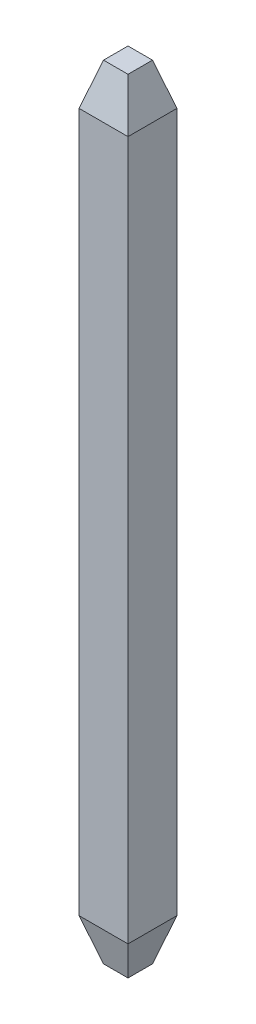
ISO-10303-21;
HEADER;
FILE_DESCRIPTION(('STEP AP214'),'2;1');
FILE_NAME('part.step','',(''),(''),'','','');
FILE_SCHEMA(('AUTOMOTIVE_DESIGN { 1 0 10303 214 1 1 1 1 }'));
ENDSEC;
DATA;
#1=APPLICATION_CONTEXT('core data for automotive mechanical design processes');
#2=APPLICATION_PROTOCOL_DEFINITION('international standard','automotive_design',2000,#1);
#3=PRODUCT_CONTEXT('',#1,'mechanical');
#4=PRODUCT('Part','Part','',(#3));
#5=PRODUCT_RELATED_PRODUCT_CATEGORY('part','',(#4));
#6=PRODUCT_DEFINITION_FORMATION('','',#4);
#7=PRODUCT_DEFINITION_CONTEXT('part definition',#1,'design');
#8=PRODUCT_DEFINITION('design','',#6,#7);
#9=PRODUCT_DEFINITION_SHAPE('','',#8);
#10=(LENGTH_UNIT() NAMED_UNIT(*) SI_UNIT(.MILLI.,.METRE.));
#11=(NAMED_UNIT(*) PLANE_ANGLE_UNIT() SI_UNIT($,.RADIAN.));
#12=(NAMED_UNIT(*) SI_UNIT($,.STERADIAN.) SOLID_ANGLE_UNIT());
#13=UNCERTAINTY_MEASURE_WITH_UNIT(LENGTH_MEASURE(1.E-05),#10,'distance_accuracy_value','');
#14=(GEOMETRIC_REPRESENTATION_CONTEXT(3) GLOBAL_UNCERTAINTY_ASSIGNED_CONTEXT((#13)) GLOBAL_UNIT_ASSIGNED_CONTEXT((#10,
#11,#12)) REPRESENTATION_CONTEXT('',''));
#15=CARTESIAN_POINT('',(0.,0.,0.));
#16=DIRECTION('',(0.,0.,1.));
#17=DIRECTION('',(1.,0.,0.));
#18=AXIS2_PLACEMENT_3D('',#15,#16,#17);
#19=CARTESIAN_POINT('',(-28.729999999987,-10.1039999999833,-19.5199999999763));
#20=DIRECTION('',(0.959644900900969,-0.281214622974642,0.));
#21=DIRECTION('',(0.,0.,-1.));
#22=AXIS2_PLACEMENT_3D('',#19,#20,#21);
#23=PLANE('',#22);
#24=DIRECTION('',(0.,0.,1.));
#25=VECTOR('',#24,1.);
#26=CARTESIAN_POINT('',(-28.729999999987,-10.1039999999833,-19.8399999999763));
#27=LINE('',#26,#25);
#28=CARTESIAN_POINT('',(-28.729999999987,-10.1039999999833,-19.8399999999763));
#29=VERTEX_POINT('',#28);
#30=CARTESIAN_POINT('',(-28.729999999987,-10.1039999999833,-19.1999999999763));
#31=VERTEX_POINT('',#30);
#32=EDGE_CURVE('E11',#29,#31,#27,.T.);
#33=ORIENTED_EDGE('',*,*,#32,.T.);
#34=DIRECTION('',(-0.270714017147726,-0.923811583516618,-0.270714017147726));
#35=VECTOR('',#34,1.);
#36=CARTESIAN_POINT('',(-28.729999999987,-10.1039999999833,-19.1999999999763));
#37=LINE('',#36,#35);
#38=CARTESIAN_POINT('',(-28.889999999987,-10.6499999999833,-19.3599999999763));
#39=VERTEX_POINT('',#38);
#40=EDGE_CURVE('E28',#31,#39,#37,.T.);
#41=ORIENTED_EDGE('',*,*,#40,.T.);
#42=DIRECTION('',(0.,0.,1.));
#43=VECTOR('',#42,1.);
#44=CARTESIAN_POINT('',(-28.889999999987,-10.6499999999833,-19.6799999999763));
#45=LINE('',#44,#43);
#46=CARTESIAN_POINT('',(-28.889999999987,-10.6499999999833,-19.6799999999763));
#47=VERTEX_POINT('',#46);
#48=EDGE_CURVE('E168',#47,#39,#45,.T.);
#49=ORIENTED_EDGE('',*,*,#48,.F.);
#50=DIRECTION('',(-0.270714017147726,-0.923811583516618,0.270714017147726));
#51=VECTOR('',#50,1.);
#52=CARTESIAN_POINT('',(-28.729999999987,-10.1039999999833,-19.8399999999763));
#53=LINE('',#52,#51);
#54=EDGE_CURVE('E131',#29,#47,#53,.T.);
#55=ORIENTED_EDGE('',*,*,#54,.F.);
#56=EDGE_LOOP('',(#33,#41,#49,#55));
#57=FACE_BOUND('',#56,.T.);
#58=ADVANCED_FACE('F17',(#57),#23,.T.);
#59=CARTESIAN_POINT('',(-28.729999999987,-11.0738701069128,-19.5199999999763));
#60=DIRECTION('',(1.,0.,0.));
#61=DIRECTION('',(0.,1.,0.));
#62=AXIS2_PLACEMENT_3D('',#59,#60,#61);
#63=PLANE('',#62);
#64=DIRECTION('',(0.,1.,0.));
#65=VECTOR('',#64,1.);
#66=CARTESIAN_POINT('',(-28.729999999987,-10.1039999999833,-19.1999999999763));
#67=LINE('',#66,#65);
#68=CARTESIAN_POINT('',(-28.729999999987,-0.965870106912755,-19.1999999999763));
#69=VERTEX_POINT('',#68);
#70=EDGE_CURVE('E41',#31,#69,#67,.T.);
#71=ORIENTED_EDGE('',*,*,#70,.F.);
#72=ORIENTED_EDGE('',*,*,#32,.F.);
#73=DIRECTION('',(0.,1.,0.));
#74=VECTOR('',#73,1.);
#75=CARTESIAN_POINT('',(-28.729999999987,-10.1039999999833,-19.8399999999763));
#76=LINE('',#75,#74);
#77=CARTESIAN_POINT('',(-28.729999999987,-0.965870106912755,-19.8399999999763));
#78=VERTEX_POINT('',#77);
#79=EDGE_CURVE('E147',#29,#78,#76,.T.);
#80=ORIENTED_EDGE('',*,*,#79,.T.);
#81=DIRECTION('',(0.,0.,1.));
#82=VECTOR('',#81,1.);
#83=CARTESIAN_POINT('',(-28.729999999987,-0.965870106912753,-19.8399999999763));
#84=LINE('',#83,#82);
#85=EDGE_CURVE('E153',#78,#69,#84,.T.);
#86=ORIENTED_EDGE('',*,*,#85,.T.);
#87=EDGE_LOOP('',(#71,#72,#80,#86));
#88=FACE_BOUND('',#87,.T.);
#89=ADVANCED_FACE('F362',(#88),#63,.T.);
#90=CARTESIAN_POINT('',(-29.370999999987,-5.53543505344803,-19.1999999999763));
#91=DIRECTION('',(0.,0.,1.));
#92=DIRECTION('',(1.,0.,0.));
#93=AXIS2_PLACEMENT_3D('',#90,#91,#92);
#94=PLANE('',#93);
#95=DIRECTION('',(0.,1.,0.));
#96=VECTOR('',#95,1.);
#97=CARTESIAN_POINT('',(-29.369999999987,-10.1039999999833,-19.1999999999763));
#98=LINE('',#97,#96);
#99=CARTESIAN_POINT('',(-29.369999999987,-10.1039999999833,-19.1999999999763));
#100=VERTEX_POINT('',#99);
#101=CARTESIAN_POINT('',(-29.369999999987,-0.965870106912755,-19.1999999999763));
#102=VERTEX_POINT('',#101);
#103=EDGE_CURVE('E99',#100,#102,#98,.T.);
#104=ORIENTED_EDGE('',*,*,#103,.F.);
#105=DIRECTION('',(-1.,0.,0.));
#106=VECTOR('',#105,1.);
#107=CARTESIAN_POINT('',(-28.729999999987,-10.1039999999833,-19.1999999999763));
#108=LINE('',#107,#106);
#109=EDGE_CURVE('E144',#31,#100,#108,.T.);
#110=ORIENTED_EDGE('',*,*,#109,.F.);
#111=ORIENTED_EDGE('',*,*,#70,.T.);
#112=DIRECTION('',(-1.,0.,0.));
#113=VECTOR('',#112,1.);
#114=CARTESIAN_POINT('',(-28.729999999987,-0.965870106912753,-19.1999999999763));
#115=LINE('',#114,#113);
#116=EDGE_CURVE('E111',#69,#102,#115,.T.);
#117=ORIENTED_EDGE('',*,*,#116,.T.);
#118=EDGE_LOOP('',(#104,#110,#111,#117));
#119=FACE_BOUND('',#118,.T.);
#120=ADVANCED_FACE('F113',(#119),#94,.T.);
#121=CARTESIAN_POINT('',(-29.369999999987,-5.53543505344803,-19.1989999999763));
#122=DIRECTION('',(-1.,0.,0.));
#123=DIRECTION('',(0.,0.,1.));
#124=AXIS2_PLACEMENT_3D('',#121,#122,#123);
#125=PLANE('',#124);
#126=DIRECTION('',(0.,1.,0.));
#127=VECTOR('',#126,1.);
#128=CARTESIAN_POINT('',(-29.369999999987,-10.1039999999833,-19.8399999999763));
#129=LINE('',#128,#127);
#130=CARTESIAN_POINT('',(-29.369999999987,-10.1039999999833,-19.8399999999763));
#131=VERTEX_POINT('',#130);
#132=CARTESIAN_POINT('',(-29.369999999987,-0.965870106912755,-19.8399999999763));
#133=VERTEX_POINT('',#132);
#134=EDGE_CURVE('E182',#131,#133,#129,.T.);
#135=ORIENTED_EDGE('',*,*,#134,.F.);
#136=DIRECTION('',(0.,0.,-1.));
#137=VECTOR('',#136,1.);
#138=CARTESIAN_POINT('',(-29.369999999987,-10.1039999999833,-19.1999999999763));
#139=LINE('',#138,#137);
#140=EDGE_CURVE('E106',#100,#131,#139,.T.);
#141=ORIENTED_EDGE('',*,*,#140,.F.);
#142=ORIENTED_EDGE('',*,*,#103,.T.);
#143=DIRECTION('',(0.,0.,-1.));
#144=VECTOR('',#143,1.);
#145=CARTESIAN_POINT('',(-29.369999999987,-0.965870106912753,-19.1999999999763));
#146=LINE('',#145,#144);
#147=EDGE_CURVE('E86',#102,#133,#146,.T.);
#148=ORIENTED_EDGE('',*,*,#147,.T.);
#149=EDGE_LOOP('',(#135,#141,#142,#148));
#150=FACE_BOUND('',#149,.T.);
#151=ADVANCED_FACE('F104',(#150),#125,.T.);
#152=CARTESIAN_POINT('',(-29.369999999987,-0.965870106912753,-19.5199999999763));
#153=DIRECTION('',(-0.959644900900968,0.281214622974644,0.));
#154=DIRECTION('',(0.,0.,1.));
#155=AXIS2_PLACEMENT_3D('',#152,#153,#154);
#156=PLANE('',#155);
#157=DIRECTION('',(0.270714017147727,0.923811583516617,-0.270714017147727));
#158=VECTOR('',#157,1.);
#159=CARTESIAN_POINT('',(-29.369999999987,-0.965870106912753,-19.1999999999763));
#160=LINE('',#159,#158);
#161=CARTESIAN_POINT('',(-29.209999999987,-0.419870106912756,-19.3599999999763));
#162=VERTEX_POINT('',#161);
#163=EDGE_CURVE('E92',#102,#162,#160,.T.);
#164=ORIENTED_EDGE('',*,*,#163,.T.);
#165=DIRECTION('',(0.,0.,-1.));
#166=VECTOR('',#165,1.);
#167=CARTESIAN_POINT('',(-29.209999999987,-0.419870106912754,-19.3599999999763));
#168=LINE('',#167,#166);
#169=CARTESIAN_POINT('',(-29.209999999987,-0.419870106912756,-19.6799999999763));
#170=VERTEX_POINT('',#169);
#171=EDGE_CURVE('E122',#162,#170,#168,.T.);
#172=ORIENTED_EDGE('',*,*,#171,.T.);
#173=DIRECTION('',(0.270714017147727,0.923811583516617,0.270714017147727));
#174=VECTOR('',#173,1.);
#175=CARTESIAN_POINT('',(-29.369999999987,-0.965870106912753,-19.8399999999763));
#176=LINE('',#175,#174);
#177=EDGE_CURVE('E95',#133,#170,#176,.T.);
#178=ORIENTED_EDGE('',*,*,#177,.F.);
#179=ORIENTED_EDGE('',*,*,#147,.F.);
#180=EDGE_LOOP('',(#164,#172,#178,#179));
#181=FACE_BOUND('',#180,.T.);
#182=ADVANCED_FACE('F88',(#181),#156,.T.);
#183=CARTESIAN_POINT('',(-29.049999999987,-0.965870106912753,-19.8399999999763));
#184=DIRECTION('',(0.,0.281214622974644,-0.959644900900968));
#185=DIRECTION('',(-1.,0.,0.));
#186=AXIS2_PLACEMENT_3D('',#183,#184,#185);
#187=PLANE('',#186);
#188=ORIENTED_EDGE('',*,*,#177,.T.);
#189=DIRECTION('',(1.,0.,0.));
#190=VECTOR('',#189,1.);
#191=CARTESIAN_POINT('',(-29.209999999987,-0.419870106912754,-19.6799999999763));
#192=LINE('',#191,#190);
#193=CARTESIAN_POINT('',(-28.889999999987,-0.419870106912756,-19.6799999999763));
#194=VERTEX_POINT('',#193);
#195=EDGE_CURVE('E21',#170,#194,#192,.T.);
#196=ORIENTED_EDGE('',*,*,#195,.T.);
#197=DIRECTION('',(-0.270714017147727,0.923811583516617,0.270714017147727));
#198=VECTOR('',#197,1.);
#199=CARTESIAN_POINT('',(-28.729999999987,-0.965870106912753,-19.8399999999763));
#200=LINE('',#199,#198);
#201=EDGE_CURVE('E179',#78,#194,#200,.T.);
#202=ORIENTED_EDGE('',*,*,#201,.F.);
#203=DIRECTION('',(1.,0.,0.));
#204=VECTOR('',#203,1.);
#205=CARTESIAN_POINT('',(-29.369999999987,-0.965870106912753,-19.8399999999763));
#206=LINE('',#205,#204);
#207=EDGE_CURVE('E180',#133,#78,#206,.T.);
#208=ORIENTED_EDGE('',*,*,#207,.F.);
#209=EDGE_LOOP('',(#188,#196,#202,#208));
#210=FACE_BOUND('',#209,.T.);
#211=ADVANCED_FACE('F309',(#210),#187,.T.);
#212=CARTESIAN_POINT('',(-29.049999999987,-0.419870106912754,-19.6809999999763));
#213=DIRECTION('',(0.,1.,0.));
#214=DIRECTION('',(1.,0.,0.));
#215=AXIS2_PLACEMENT_3D('',#212,#213,#214);
#216=PLANE('',#215);
#217=ORIENTED_EDGE('',*,*,#195,.F.);
#218=ORIENTED_EDGE('',*,*,#171,.F.);
#219=DIRECTION('',(-1.,0.,0.));
#220=VECTOR('',#219,1.);
#221=CARTESIAN_POINT('',(-28.889999999987,-0.419870106912754,-19.3599999999763));
#222=LINE('',#221,#220);
#223=CARTESIAN_POINT('',(-28.889999999987,-0.419870106912756,-19.3599999999763));
#224=VERTEX_POINT('',#223);
#225=EDGE_CURVE('E120',#224,#162,#222,.T.);
#226=ORIENTED_EDGE('',*,*,#225,.F.);
#227=DIRECTION('',(0.,0.,1.));
#228=VECTOR('',#227,1.);
#229=CARTESIAN_POINT('',(-28.889999999987,-0.419870106912754,-19.6799999999763));
#230=LINE('',#229,#228);
#231=EDGE_CURVE('E184',#194,#224,#230,.T.);
#232=ORIENTED_EDGE('',*,*,#231,.F.);
#233=EDGE_LOOP('',(#217,#218,#226,#232));
#234=FACE_BOUND('',#233,.T.);
#235=ADVANCED_FACE('F304',(#234),#216,.T.);
#236=CARTESIAN_POINT('',(-29.369999999987,-10.1039999999833,-19.5199999999763));
#237=DIRECTION('',(-0.959644900900969,-0.281214622974642,0.));
#238=DIRECTION('',(-0.281214622974642,0.959644900900969,0.));
#239=AXIS2_PLACEMENT_3D('',#236,#237,#238);
#240=PLANE('',#239);
#241=ORIENTED_EDGE('',*,*,#140,.T.);
#242=DIRECTION('',(0.270714017147726,-0.923811583516618,0.270714017147726));
#243=VECTOR('',#242,1.);
#244=CARTESIAN_POINT('',(-29.369999999987,-10.1039999999833,-19.8399999999763));
#245=LINE('',#244,#243);
#246=CARTESIAN_POINT('',(-29.209999999987,-10.6499999999833,-19.6799999999763));
#247=VERTEX_POINT('',#246);
#248=EDGE_CURVE('E135',#131,#247,#245,.T.);
#249=ORIENTED_EDGE('',*,*,#248,.T.);
#250=DIRECTION('',(0.,0.,-1.));
#251=VECTOR('',#250,1.);
#252=CARTESIAN_POINT('',(-29.209999999987,-10.6499999999833,-19.3599999999763));
#253=LINE('',#252,#251);
#254=CARTESIAN_POINT('',(-29.209999999987,-10.6499999999833,-19.3599999999763));
#255=VERTEX_POINT('',#254);
#256=EDGE_CURVE('E143',#255,#247,#253,.T.);
#257=ORIENTED_EDGE('',*,*,#256,.F.);
#258=DIRECTION('',(0.270714017147726,-0.923811583516618,-0.270714017147726));
#259=VECTOR('',#258,1.);
#260=CARTESIAN_POINT('',(-29.369999999987,-10.1039999999833,-19.1999999999763));
#261=LINE('',#260,#259);
#262=EDGE_CURVE('E170',#100,#255,#261,.T.);
#263=ORIENTED_EDGE('',*,*,#262,.F.);
#264=EDGE_LOOP('',(#241,#249,#257,#263));
#265=FACE_BOUND('',#264,.T.);
#266=ADVANCED_FACE('F211',(#265),#240,.T.);
#267=CARTESIAN_POINT('',(-29.049999999987,-0.965870106912753,-19.1999999999763));
#268=DIRECTION('',(0.,0.281214622974644,0.959644900900968));
#269=DIRECTION('',(1.,0.,0.));
#270=AXIS2_PLACEMENT_3D('',#267,#268,#269);
#271=PLANE('',#270);
#272=DIRECTION('',(-0.270714017147727,0.923811583516617,-0.270714017147727));
#273=VECTOR('',#272,1.);
#274=CARTESIAN_POINT('',(-28.729999999987,-0.965870106912753,-19.1999999999763));
#275=LINE('',#274,#273);
#276=EDGE_CURVE('E136',#69,#224,#275,.T.);
#277=ORIENTED_EDGE('',*,*,#276,.T.);
#278=ORIENTED_EDGE('',*,*,#225,.T.);
#279=ORIENTED_EDGE('',*,*,#163,.F.);
#280=ORIENTED_EDGE('',*,*,#116,.F.);
#281=EDGE_LOOP('',(#277,#278,#279,#280));
#282=FACE_BOUND('',#281,.T.);
#283=ADVANCED_FACE('F118',(#282),#271,.T.);
#284=CARTESIAN_POINT('',(-28.729999999987,-0.965870106912753,-19.5199999999763));
#285=DIRECTION('',(0.959644900900968,0.281214622974644,0.));
#286=DIRECTION('',(0.,0.,-1.));
#287=AXIS2_PLACEMENT_3D('',#284,#285,#286);
#288=PLANE('',#287);
#289=ORIENTED_EDGE('',*,*,#201,.T.);
#290=ORIENTED_EDGE('',*,*,#231,.T.);
#291=ORIENTED_EDGE('',*,*,#276,.F.);
#292=ORIENTED_EDGE('',*,*,#85,.F.);
#293=EDGE_LOOP('',(#289,#290,#291,#292));
#294=FACE_BOUND('',#293,.T.);
#295=ADVANCED_FACE('F334',(#294),#288,.T.);
#296=CARTESIAN_POINT('',(-28.728999999987,-5.53443505344803,-19.8399999999763));
#297=DIRECTION('',(0.,0.,-1.));
#298=DIRECTION('',(0.,-1.,0.));
#299=AXIS2_PLACEMENT_3D('',#296,#297,#298);
#300=PLANE('',#299);
#301=ORIENTED_EDGE('',*,*,#79,.F.);
#302=DIRECTION('',(1.,0.,0.));
#303=VECTOR('',#302,1.);
#304=CARTESIAN_POINT('',(-29.369999999987,-10.1039999999833,-19.8399999999763));
#305=LINE('',#304,#303);
#306=EDGE_CURVE('E183',#131,#29,#305,.T.);
#307=ORIENTED_EDGE('',*,*,#306,.F.);
#308=ORIENTED_EDGE('',*,*,#134,.T.);
#309=ORIENTED_EDGE('',*,*,#207,.T.);
#310=EDGE_LOOP('',(#301,#307,#308,#309));
#311=FACE_BOUND('',#310,.T.);
#312=ADVANCED_FACE('F298',(#311),#300,.T.);
#313=CARTESIAN_POINT('',(-29.049999999987,-10.1039999999833,-19.8399999999763));
#314=DIRECTION('',(0.,-0.281214622974642,-0.959644900900969));
#315=DIRECTION('',(0.,-0.959644900900969,0.281214622974642));
#316=AXIS2_PLACEMENT_3D('',#313,#314,#315);
#317=PLANE('',#316);
#318=ORIENTED_EDGE('',*,*,#306,.T.);
#319=ORIENTED_EDGE('',*,*,#54,.T.);
#320=DIRECTION('',(1.,0.,0.));
#321=VECTOR('',#320,1.);
#322=CARTESIAN_POINT('',(-29.209999999987,-10.6499999999833,-19.6799999999763));
#323=LINE('',#322,#321);
#324=EDGE_CURVE('E139',#247,#47,#323,.T.);
#325=ORIENTED_EDGE('',*,*,#324,.F.);
#326=ORIENTED_EDGE('',*,*,#248,.F.);
#327=EDGE_LOOP('',(#318,#319,#325,#326));
#328=FACE_BOUND('',#327,.T.);
#329=ADVANCED_FACE('F215',(#328),#317,.T.);
#330=CARTESIAN_POINT('',(-29.210999999987,-10.6499999999833,-19.5199999999763));
#331=DIRECTION('',(0.,-1.,0.));
#332=DIRECTION('',(0.,0.,-1.));
#333=AXIS2_PLACEMENT_3D('',#330,#331,#332);
#334=PLANE('',#333);
#335=ORIENTED_EDGE('',*,*,#48,.T.);
#336=DIRECTION('',(-1.,0.,0.));
#337=VECTOR('',#336,1.);
#338=CARTESIAN_POINT('',(-28.889999999987,-10.6499999999833,-19.3599999999763));
#339=LINE('',#338,#337);
#340=EDGE_CURVE('E150',#39,#255,#339,.T.);
#341=ORIENTED_EDGE('',*,*,#340,.T.);
#342=ORIENTED_EDGE('',*,*,#256,.T.);
#343=ORIENTED_EDGE('',*,*,#324,.T.);
#344=EDGE_LOOP('',(#335,#341,#342,#343));
#345=FACE_BOUND('',#344,.T.);
#346=ADVANCED_FACE('F19',(#345),#334,.T.);
#347=CARTESIAN_POINT('',(-29.049999999987,-10.1039999999833,-19.1999999999763));
#348=DIRECTION('',(0.,-0.281214622974642,0.959644900900969));
#349=DIRECTION('',(-1.,0.,0.));
#350=AXIS2_PLACEMENT_3D('',#347,#348,#349);
#351=PLANE('',#350);
#352=ORIENTED_EDGE('',*,*,#109,.T.);
#353=ORIENTED_EDGE('',*,*,#262,.T.);
#354=ORIENTED_EDGE('',*,*,#340,.F.);
#355=ORIENTED_EDGE('',*,*,#40,.F.);
#356=EDGE_LOOP('',(#352,#353,#354,#355));
#357=FACE_BOUND('',#356,.T.);
#358=ADVANCED_FACE('F220',(#357),#351,.T.);
#359=CLOSED_SHELL('',(#58,#89,#120,#151,#182,#211,#235,#266,#283,#295,#312,#329,#346,#358));
#360=MANIFOLD_SOLID_BREP('B1',#359);
#361=ADVANCED_BREP_SHAPE_REPRESENTATION('',(#18,#360),#14);
#362=SHAPE_DEFINITION_REPRESENTATION(#9,#361);
ENDSEC;
END-ISO-10303-21;
